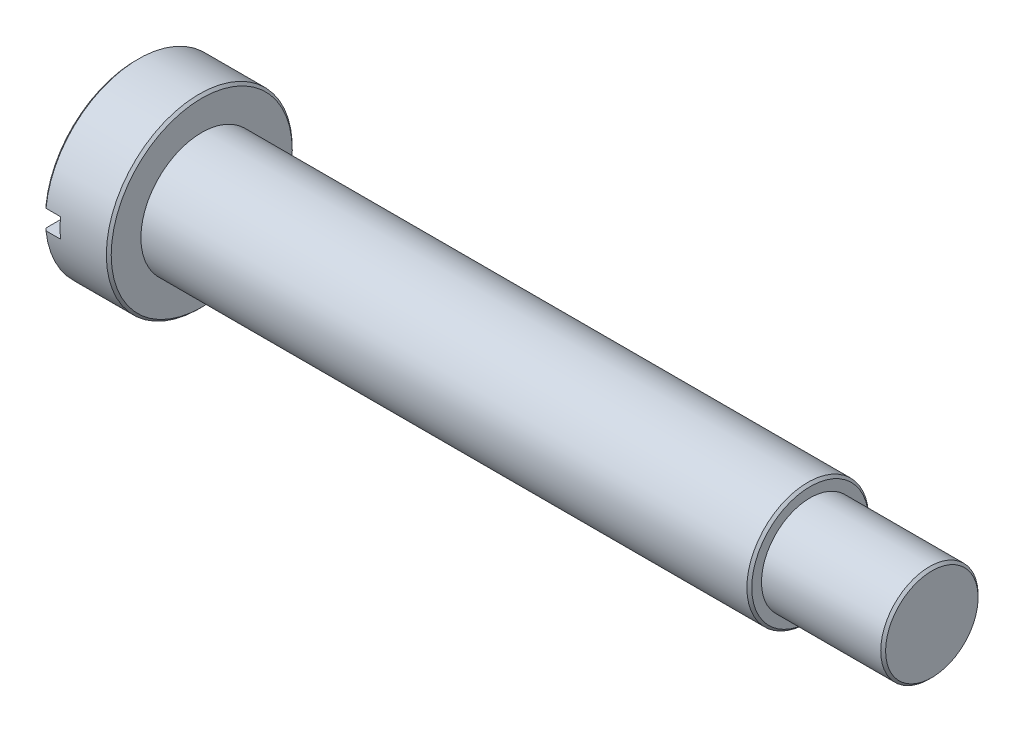
ISO-10303-21;
HEADER;
FILE_DESCRIPTION(('STEP AP214'),'2;1');
FILE_NAME('part.step','',(''),(''),'','','');
FILE_SCHEMA(('AUTOMOTIVE_DESIGN { 1 0 10303 214 1 1 1 1 }'));
ENDSEC;
DATA;
#1=APPLICATION_CONTEXT('core data for automotive mechanical design processes');
#2=APPLICATION_PROTOCOL_DEFINITION('international standard','automotive_design',2000,#1);
#3=PRODUCT_CONTEXT('',#1,'mechanical');
#4=PRODUCT('Part','Part','',(#3));
#5=PRODUCT_RELATED_PRODUCT_CATEGORY('part','',(#4));
#6=PRODUCT_DEFINITION_FORMATION('','',#4);
#7=PRODUCT_DEFINITION_CONTEXT('part definition',#1,'design');
#8=PRODUCT_DEFINITION('design','',#6,#7);
#9=PRODUCT_DEFINITION_SHAPE('','',#8);
#10=(LENGTH_UNIT() NAMED_UNIT(*) SI_UNIT(.MILLI.,.METRE.));
#11=(NAMED_UNIT(*) PLANE_ANGLE_UNIT() SI_UNIT($,.RADIAN.));
#12=(NAMED_UNIT(*) SI_UNIT($,.STERADIAN.) SOLID_ANGLE_UNIT());
#13=UNCERTAINTY_MEASURE_WITH_UNIT(LENGTH_MEASURE(1.E-05),#10,'distance_accuracy_value','');
#14=(GEOMETRIC_REPRESENTATION_CONTEXT(3) GLOBAL_UNCERTAINTY_ASSIGNED_CONTEXT((#13)) GLOBAL_UNIT_ASSIGNED_CONTEXT((#10,
#11,#12)) REPRESENTATION_CONTEXT('',''));
#15=CARTESIAN_POINT('',(0.,0.,0.));
#16=DIRECTION('',(0.,0.,1.));
#17=DIRECTION('',(1.,0.,0.));
#18=AXIS2_PLACEMENT_3D('',#15,#16,#17);
#19=CARTESIAN_POINT('',(0.,0.,0.));
#20=DIRECTION('',(1.,0.,0.));
#21=DIRECTION('',(0.,0.,-1.));
#22=AXIS2_PLACEMENT_3D('',#19,#20,#21);
#23=PLANE('',#22);
#24=DIRECTION('',(0.,0.,1.));
#25=VECTOR('',#24,1.);
#26=CARTESIAN_POINT('',(0.,-0.4,-4.02178863795477));
#27=LINE('',#26,#25);
#28=CARTESIAN_POINT('',(0.,-0.4,-3.69843210022842));
#29=VERTEX_POINT('',#28);
#30=CARTESIAN_POINT('',(0.,-0.4,3.69843210022842));
#31=VERTEX_POINT('',#30);
#32=EDGE_CURVE('E71',#29,#31,#27,.T.);
#33=ORIENTED_EDGE('',*,*,#32,.F.);
#34=CARTESIAN_POINT('',(0.,0.,0.));
#35=DIRECTION('',(1.,0.,0.));
#36=DIRECTION('',(0.,0.,-1.));
#37=AXIS2_PLACEMENT_3D('',#34,#35,#36);
#38=CIRCLE('',#37,3.72);
#39=EDGE_CURVE('E81',#29,#31,#38,.F.);
#40=ORIENTED_EDGE('',*,*,#39,.T.);
#41=EDGE_LOOP('',(#33,#40));
#42=FACE_BOUND('',#41,.T.);
#43=ADVANCED_FACE('F16',(#42),#23,.F.);
#44=CARTESIAN_POINT('',(0.,0.,0.));
#45=DIRECTION('',(-1.,0.,0.));
#46=DIRECTION('',(0.,0.,1.));
#47=AXIS2_PLACEMENT_3D('',#44,#45,#46);
#48=CYLINDRICAL_SURFACE('',#47,3.82);
#49=CARTESIAN_POINT('',(2.6,0.,0.));
#50=DIRECTION('',(-1.,0.,0.));
#51=DIRECTION('',(0.,0.,1.));
#52=AXIS2_PLACEMENT_3D('',#49,#50,#51);
#53=CIRCLE('',#52,3.82);
#54=CARTESIAN_POINT('',(2.6,0.,3.82));
#55=VERTEX_POINT('',#54);
#56=EDGE_CURVE('E91',#55,#55,#53,.T.);
#57=ORIENTED_EDGE('',*,*,#56,.T.);
#58=EDGE_LOOP('',(#57));
#59=FACE_BOUND('',#58,.T.);
#60=DIRECTION('',(-1.,0.,0.));
#61=VECTOR('',#60,1.);
#62=CARTESIAN_POINT('',(0.,-0.4,3.79899986838642));
#63=LINE('',#62,#61);
#64=CARTESIAN_POINT('',(0.1,-0.4,3.79899986838642));
#65=VERTEX_POINT('',#64);
#66=CARTESIAN_POINT('',(0.7,-0.4,3.79899986838642));
#67=VERTEX_POINT('',#66);
#68=EDGE_CURVE('E58',#65,#67,#63,.F.);
#69=ORIENTED_EDGE('',*,*,#68,.F.);
#70=CARTESIAN_POINT('',(0.1,0.,0.));
#71=DIRECTION('',(1.,0.,0.));
#72=DIRECTION('',(0.,0.,-1.));
#73=AXIS2_PLACEMENT_3D('',#70,#71,#72);
#74=CIRCLE('',#73,3.82);
#75=CARTESIAN_POINT('',(0.1,-0.4,-3.79899986838642));
#76=VERTEX_POINT('',#75);
#77=EDGE_CURVE('E79',#65,#76,#74,.T.);
#78=ORIENTED_EDGE('',*,*,#77,.T.);
#79=DIRECTION('',(-1.,0.,0.));
#80=VECTOR('',#79,1.);
#81=CARTESIAN_POINT('',(0.,-0.4,-3.79899986838642));
#82=LINE('',#81,#80);
#83=CARTESIAN_POINT('',(0.7,-0.4,-3.79899986838642));
#84=VERTEX_POINT('',#83);
#85=EDGE_CURVE('E65',#84,#76,#82,.T.);
#86=ORIENTED_EDGE('',*,*,#85,.F.);
#87=CARTESIAN_POINT('',(0.7,0.,0.));
#88=DIRECTION('',(1.,0.,0.));
#89=DIRECTION('',(0.,0.,-1.));
#90=AXIS2_PLACEMENT_3D('',#87,#88,#89);
#91=CIRCLE('',#90,3.82);
#92=CARTESIAN_POINT('',(0.7,0.4,-3.79899986838642));
#93=VERTEX_POINT('',#92);
#94=EDGE_CURVE('E215',#84,#93,#91,.T.);
#95=ORIENTED_EDGE('',*,*,#94,.T.);
#96=DIRECTION('',(-1.,0.,0.));
#97=VECTOR('',#96,1.);
#98=CARTESIAN_POINT('',(0.,0.4,-3.79899986838642));
#99=LINE('',#98,#97);
#100=CARTESIAN_POINT('',(0.1,0.4,-3.79899986838642));
#101=VERTEX_POINT('',#100);
#102=EDGE_CURVE('E206',#93,#101,#99,.T.);
#103=ORIENTED_EDGE('',*,*,#102,.T.);
#104=CARTESIAN_POINT('',(0.1,0.4,3.79899986838642));
#105=VERTEX_POINT('',#104);
#106=EDGE_CURVE('E87',#101,#105,#74,.T.);
#107=ORIENTED_EDGE('',*,*,#106,.T.);
#108=DIRECTION('',(-1.,0.,0.));
#109=VECTOR('',#108,1.);
#110=CARTESIAN_POINT('',(0.,0.4,3.79899986838642));
#111=LINE('',#110,#109);
#112=CARTESIAN_POINT('',(0.7,0.4,3.79899986838642));
#113=VERTEX_POINT('',#112);
#114=EDGE_CURVE('E72',#105,#113,#111,.F.);
#115=ORIENTED_EDGE('',*,*,#114,.T.);
#116=EDGE_CURVE('E185',#113,#67,#91,.T.);
#117=ORIENTED_EDGE('',*,*,#116,.T.);
#118=EDGE_LOOP('',(#69,#78,#86,#95,#103,#107,#115,#117));
#119=FACE_BOUND('',#118,.T.);
#120=ADVANCED_FACE('F85',(#59,#119),#48,.T.);
#121=CARTESIAN_POINT('',(0.,0.,0.));
#122=DIRECTION('',(1.,0.,0.));
#123=DIRECTION('',(0.,0.,-1.));
#124=AXIS2_PLACEMENT_3D('',#121,#122,#123);
#125=CONICAL_SURFACE('',#124,3.72,0.785398163397463);
#126=ORIENTED_EDGE('',*,*,#77,.F.);
#127=CARTESIAN_POINT('',(0.1007,-0.4,3.7997037371353));
#128=CARTESIAN_POINT('',(-0.00972371970865544,-0.4,3.68866729835541));
#129=CARTESIAN_POINT('',(-0.120123222613816,-0.4,3.57760675645919));
#130=CARTESIAN_POINT('',(-0.340866293965101,-0.4,3.35540033500685));
#131=CARTESIAN_POINT('',(-0.451209852856851,-0.4,3.24425444595992));
#132=CARTESIAN_POINT('',(-0.672160782659812,-0.4,3.02151019475965));
#133=CARTESIAN_POINT('',(-0.782767851250642,-0.4,2.90991153260454));
#134=CARTESIAN_POINT('',(-1.00383405554618,-0.4,2.68659720077042));
#135=CARTESIAN_POINT('',(-1.1142932089712,-0.4,2.57488154862966));
#136=CARTESIAN_POINT('',(-1.37677934485607,-0.4,2.30896314497578));
#137=CARTESIAN_POINT('',(-1.52872188103554,-0.4,2.15467689965763));
#138=CARTESIAN_POINT('',(-1.75617017140396,-0.4,1.92271986173873));
#139=CARTESIAN_POINT('',(-1.83192633307621,-0.4,1.84529474735761));
#140=CARTESIAN_POINT('',(-1.98318929887579,-0.4,1.69020899067442));
#141=CARTESIAN_POINT('',(-2.05869611559696,-0.4,1.61254836065986));
#142=CARTESIAN_POINT('',(-2.20912652789578,-0.4,1.45709480485107));
#143=CARTESIAN_POINT('',(-2.28405117576121,-0.4,1.3793028999174));
#144=CARTESIAN_POINT('',(-2.43332217520878,-0.4,1.22313746860251));
#145=CARTESIAN_POINT('',(-2.50766841171401,-0.4,1.14476383225317));
#146=CARTESIAN_POINT('',(-2.65528169584368,-0.4,0.987126446716258));
#147=CARTESIAN_POINT('',(-2.72854963805339,-0.4,0.90786354420224));
#148=CARTESIAN_POINT('',(-2.8368556750095,-0.4,0.787551663029682));
#149=CARTESIAN_POINT('',(-2.87268624955578,-0.4,0.747217842692174));
#150=CARTESIAN_POINT('',(-2.94351939455795,-0.4,0.665831381432158));
#151=CARTESIAN_POINT('',(-2.97852206733132,-0.4,0.624778830437884));
#152=CARTESIAN_POINT('',(-3.02622994148695,-0.4,0.566921061568795));
#153=CARTESIAN_POINT('',(-3.03951592354927,-0.4,0.550595790860314));
#154=CARTESIAN_POINT('',(-3.06582172752263,-0.4,0.517731680880178));
#155=CARTESIAN_POINT('',(-3.07884153623833,-0.4,0.501192831086506));
#156=CARTESIAN_POINT('',(-3.11746393595511,-0.4,0.451117290517626));
#157=CARTESIAN_POINT('',(-3.14257199609554,-0.4,0.41719033959251));
#158=CARTESIAN_POINT('',(-3.19001337606982,-0.4,0.348555883904446));
#159=CARTESIAN_POINT('',(-3.21239640063317,-0.4,0.313883094724452));
#160=CARTESIAN_POINT('',(-3.2532399648461,-0.4,0.242340300030416));
#161=CARTESIAN_POINT('',(-3.27171685404829,-0.4,0.205480314595571));
#162=CARTESIAN_POINT('',(-3.29570703953476,-0.4,0.143195664004333));
#163=CARTESIAN_POINT('',(-3.30348274034931,-0.4,0.11867747207689));
#164=CARTESIAN_POINT('',(-3.31485026142036,-0.4,0.0687704372124475));
#165=CARTESIAN_POINT('',(-3.31846478942032,-0.4,0.0433871055109426));
#166=CARTESIAN_POINT('',(-3.3207442045827,-0.4,-0.00780300542246746));
#167=CARTESIAN_POINT('',(-3.31937274951796,-0.4,-0.0336115233253419));
#168=CARTESIAN_POINT('',(-3.31193891452746,-0.4,-0.0846123821800508));
#169=CARTESIAN_POINT('',(-3.30585587531209,-0.4,-0.109801504048273));
#170=CARTESIAN_POINT('',(-3.29180716381071,-0.4,-0.153928519325698));
#171=CARTESIAN_POINT('',(-3.28448790335838,-0.4,-0.173084817302385));
#172=CARTESIAN_POINT('',(-3.26821785185456,-0.4,-0.210700379357752));
#173=CARTESIAN_POINT('',(-3.25926568099253,-0.4,-0.229159037884277));
#174=CARTESIAN_POINT('',(-3.24014301093223,-0.4,-0.265524721764036));
#175=CARTESIAN_POINT('',(-3.22996743274077,-0.4,-0.283429030241373));
#176=CARTESIAN_POINT('',(-3.20875241480667,-0.4,-0.318702141179415));
#177=CARTESIAN_POINT('',(-3.19771336182962,-0.4,-0.336071178592515));
#178=CARTESIAN_POINT('',(-3.15916074661242,-0.4,-0.394338436316087));
#179=CARTESIAN_POINT('',(-3.13015663523335,-0.4,-0.434243417041458));
#180=CARTESIAN_POINT('',(-3.07026411311731,-0.4,-0.512623361721481));
#181=CARTESIAN_POINT('',(-3.03937400706867,-0.4,-0.551096987526727));
#182=CARTESIAN_POINT('',(-2.97640342098523,-0.4,-0.627211094419027));
#183=CARTESIAN_POINT('',(-2.94432026235579,-0.4,-0.664849354717811));
#184=CARTESIAN_POINT('',(-2.87945873095953,-0.4,-0.73949047105323));
#185=CARTESIAN_POINT('',(-2.84668064295612,-0.4,-0.776493576525954));
#186=CARTESIAN_POINT('',(-2.74740878449286,-0.4,-0.887138172717233));
#187=CARTESIAN_POINT('',(-2.68020827487207,-0.4,-0.960144088612486));
#188=CARTESIAN_POINT('',(-2.54495998246372,-0.4,-1.10515969558673));
#189=CARTESIAN_POINT('',(-2.47691357493903,-0.4,-1.17717068177926));
#190=CARTESIAN_POINT('',(-2.30464527557632,-0.4,-1.35807148660064));
#191=CARTESIAN_POINT('',(-2.20005930610626,-0.4,-1.46661441852072));
#192=CARTESIAN_POINT('',(-1.99024071578729,-0.4,-1.68307603412219));
#193=CARTESIAN_POINT('',(-1.88500807789701,-0.4,-1.79099470120586));
#194=CARTESIAN_POINT('',(-1.5686133180435,-0.4,-2.11435634893406));
#195=CARTESIAN_POINT('',(-1.3568971577934,-0.4,-2.32925701010926));
#196=CARTESIAN_POINT('',(-0.937619570011003,-0.4,-2.75365575466617));
#197=CARTESIAN_POINT('',(-0.73007138311911,-0.4,-2.96316696702083));
#198=CARTESIAN_POINT('',(-0.418586842408643,-0.4,-3.27711768345285));
#199=CARTESIAN_POINT('',(-0.314770508333443,-0.4,-3.38167616062694));
#200=CARTESIAN_POINT('',(-0.1070766662361,-0.4,-3.59073153550957));
#201=CARTESIAN_POINT('',(-0.00319915845335339,-0.4,-3.69522843345593));
#202=CARTESIAN_POINT('',(0.100699999999998,-0.4,-3.7997037371353));
#203=B_SPLINE_CURVE_WITH_KNOTS('',3,(#127,#128,#129,#130,#131,#132,#133,#134,#135,#136,#137,
#138,#139,#140,#141,#142,#143,#144,#145,#146,#147,#148,#149,#150,#151,#152,#153,#154,#155,#156,
#157,#158,#159,#160,#161,#162,#163,#164,#165,#166,#167,#168,#169,#170,#171,#172,#173,#174,#175,
#176,#177,#178,#179,#180,#181,#182,#183,#184,#185,#186,#187,#188,#189,#190,#191,#192,#193,#194,
#195,#196,#197,#198,#199,#200,#201,#202),.UNSPECIFIED.,.F.,.F.,(4,2,2,2,2,2,2,2,2,2,2,2,2,2,2,2,
2,2,2,2,2,2,2,2,2,2,2,2,2,2,2,2,2,2,2,2,2,4),(0.,0.469789752238243,0.939642877822411,
1.41101700288855,1.88232842815591,2.53195545739926,2.8569209029871,3.1818696762835,
3.50588500997478,3.82996323868161,4.15375543334238,4.31560110540631,4.47742666989952,
4.54056892533293,4.60371430344026,4.73027378918795,4.85398691523111,4.97717149944682,
5.05407625616299,5.13055931990218,5.20760097345261,5.28498236395221,5.34641526261287,
5.40790031464656,5.46965005985584,5.53137230292987,5.67923634506999,5.82723531629428,
5.97558943166404,6.12388388757924,6.42154008130772,6.71876312383801,7.17094853894681,
7.62314592183534,8.52815759394615,9.4128841158044,9.85491658820589,10.2969473420972),.UNSPECIFIED.);
#204=EDGE_CURVE('E82',#65,#31,#203,.T.);
#205=ORIENTED_EDGE('',*,*,#204,.T.);
#206=ORIENTED_EDGE('',*,*,#39,.F.);
#207=EDGE_CURVE('E51',#29,#76,#203,.T.);
#208=ORIENTED_EDGE('',*,*,#207,.T.);
#209=EDGE_LOOP('',(#126,#205,#206,#208));
#210=FACE_BOUND('',#209,.T.);
#211=ADVANCED_FACE('F77',(#210),#125,.T.);
#212=CARTESIAN_POINT('',(0.,0.4,3.69843210022842));
#213=VERTEX_POINT('',#212);
#214=CARTESIAN_POINT('',(0.,0.4,-3.69843210022842));
#215=VERTEX_POINT('',#214);
#216=EDGE_CURVE('E102',#213,#215,#38,.F.);
#217=ORIENTED_EDGE('',*,*,#216,.T.);
#218=DIRECTION('',(0.,0.,-1.));
#219=VECTOR('',#218,1.);
#220=CARTESIAN_POINT('',(0.,0.4,0.));
#221=LINE('',#220,#219);
#222=EDGE_CURVE('E34',#215,#213,#221,.F.);
#223=ORIENTED_EDGE('',*,*,#222,.T.);
#224=EDGE_LOOP('',(#217,#223));
#225=FACE_BOUND('',#224,.T.);
#226=ADVANCED_FACE('F151',(#225),#23,.F.);
#227=CARTESIAN_POINT('',(2.7,3.82,0.));
#228=DIRECTION('',(-1.,0.,0.));
#229=DIRECTION('',(0.,0.,1.));
#230=AXIS2_PLACEMENT_3D('',#227,#228,#229);
#231=PLANE('',#230);
#232=CARTESIAN_POINT('',(2.7,0.,0.));
#233=DIRECTION('',(-1.,0.,0.));
#234=DIRECTION('',(0.,0.,1.));
#235=AXIS2_PLACEMENT_3D('',#232,#233,#234);
#236=CIRCLE('',#235,3.72);
#237=CARTESIAN_POINT('',(2.7,0.,3.72));
#238=VERTEX_POINT('',#237);
#239=EDGE_CURVE('E99',#238,#238,#236,.F.);
#240=ORIENTED_EDGE('',*,*,#239,.T.);
#241=EDGE_LOOP('',(#240));
#242=FACE_BOUND('',#241,.T.);
#243=CARTESIAN_POINT('',(2.7,0.,0.));
#244=DIRECTION('',(-1.,0.,0.));
#245=DIRECTION('',(0.,0.,1.));
#246=AXIS2_PLACEMENT_3D('',#243,#244,#245);
#247=CIRCLE('',#246,2.5);
#248=CARTESIAN_POINT('',(2.7,0.,2.5));
#249=VERTEX_POINT('',#248);
#250=EDGE_CURVE('E88',#249,#249,#247,.T.);
#251=ORIENTED_EDGE('',*,*,#250,.T.);
#252=EDGE_LOOP('',(#251));
#253=FACE_BOUND('',#252,.T.);
#254=ADVANCED_FACE('F147',(#242,#253),#231,.F.);
#255=CARTESIAN_POINT('',(0.,0.,0.));
#256=DIRECTION('',(-1.,0.,0.));
#257=DIRECTION('',(0.,0.,1.));
#258=AXIS2_PLACEMENT_3D('',#255,#256,#257);
#259=CYLINDRICAL_SURFACE('',#258,2.5);
#260=CARTESIAN_POINT('',(27.6,0.,0.));
#261=DIRECTION('',(-1.,0.,0.));
#262=DIRECTION('',(0.,0.,1.));
#263=AXIS2_PLACEMENT_3D('',#260,#261,#262);
#264=CIRCLE('',#263,2.5);
#265=CARTESIAN_POINT('',(27.6,0.,2.5));
#266=VERTEX_POINT('',#265);
#267=EDGE_CURVE('E26',#266,#266,#264,.T.);
#268=ORIENTED_EDGE('',*,*,#267,.T.);
#269=EDGE_LOOP('',(#268));
#270=FACE_BOUND('',#269,.T.);
#271=ORIENTED_EDGE('',*,*,#250,.F.);
#272=EDGE_LOOP('',(#271));
#273=FACE_BOUND('',#272,.T.);
#274=ADVANCED_FACE('F143',(#270,#273),#259,.T.);
#275=CARTESIAN_POINT('',(27.7,2.5,0.));
#276=DIRECTION('',(-1.,0.,0.));
#277=DIRECTION('',(0.,0.,1.));
#278=AXIS2_PLACEMENT_3D('',#275,#276,#277);
#279=PLANE('',#278);
#280=CARTESIAN_POINT('',(27.7,0.,0.));
#281=DIRECTION('',(-1.,0.,0.));
#282=DIRECTION('',(0.,0.,1.));
#283=AXIS2_PLACEMENT_3D('',#280,#281,#282);
#284=CIRCLE('',#283,2.4);
#285=CARTESIAN_POINT('',(27.7,0.,2.4));
#286=VERTEX_POINT('',#285);
#287=EDGE_CURVE('E11',#286,#286,#284,.F.);
#288=ORIENTED_EDGE('',*,*,#287,.T.);
#289=EDGE_LOOP('',(#288));
#290=FACE_BOUND('',#289,.T.);
#291=CARTESIAN_POINT('',(27.7,0.,0.));
#292=DIRECTION('',(-1.,0.,0.));
#293=DIRECTION('',(0.,0.,1.));
#294=AXIS2_PLACEMENT_3D('',#291,#292,#293);
#295=CIRCLE('',#294,2.);
#296=CARTESIAN_POINT('',(27.7,0.,2.));
#297=VERTEX_POINT('',#296);
#298=EDGE_CURVE('E93',#297,#297,#295,.T.);
#299=ORIENTED_EDGE('',*,*,#298,.T.);
#300=EDGE_LOOP('',(#299));
#301=FACE_BOUND('',#300,.T.);
#302=ADVANCED_FACE('F139',(#290,#301),#279,.F.);
#303=CARTESIAN_POINT('',(0.,0.,0.));
#304=DIRECTION('',(-1.,0.,0.));
#305=DIRECTION('',(0.,0.,1.));
#306=AXIS2_PLACEMENT_3D('',#303,#304,#305);
#307=CYLINDRICAL_SURFACE('',#306,2.);
#308=CARTESIAN_POINT('',(32.6,0.,0.));
#309=DIRECTION('',(-1.,0.,0.));
#310=DIRECTION('',(0.,0.,1.));
#311=AXIS2_PLACEMENT_3D('',#308,#309,#310);
#312=CIRCLE('',#311,2.);
#313=CARTESIAN_POINT('',(32.6,0.,2.));
#314=VERTEX_POINT('',#313);
#315=EDGE_CURVE('E181',#314,#314,#312,.T.);
#316=ORIENTED_EDGE('',*,*,#315,.T.);
#317=EDGE_LOOP('',(#316));
#318=FACE_BOUND('',#317,.T.);
#319=ORIENTED_EDGE('',*,*,#298,.F.);
#320=EDGE_LOOP('',(#319));
#321=FACE_BOUND('',#320,.T.);
#322=ADVANCED_FACE('F135',(#318,#321),#307,.T.);
#323=CARTESIAN_POINT('',(32.7,2.,0.));
#324=DIRECTION('',(-1.,0.,0.));
#325=DIRECTION('',(0.,0.,1.));
#326=AXIS2_PLACEMENT_3D('',#323,#324,#325);
#327=PLANE('',#326);
#328=CARTESIAN_POINT('',(32.7,0.,0.));
#329=DIRECTION('',(-1.,0.,0.));
#330=DIRECTION('',(0.,0.,1.));
#331=AXIS2_PLACEMENT_3D('',#328,#329,#330);
#332=CIRCLE('',#331,1.9);
#333=CARTESIAN_POINT('',(32.7,0.,1.9));
#334=VERTEX_POINT('',#333);
#335=EDGE_CURVE('E184',#334,#334,#332,.F.);
#336=ORIENTED_EDGE('',*,*,#335,.T.);
#337=EDGE_LOOP('',(#336));
#338=FACE_BOUND('',#337,.T.);
#339=ADVANCED_FACE('F131',(#338),#327,.F.);
#340=CARTESIAN_POINT('',(2.6,0.,0.));
#341=DIRECTION('',(-1.,0.,0.));
#342=DIRECTION('',(0.,0.,1.));
#343=AXIS2_PLACEMENT_3D('',#340,#341,#342);
#344=CONICAL_SURFACE('',#343,3.82,0.78539816339745);
#345=ORIENTED_EDGE('',*,*,#239,.F.);
#346=EDGE_LOOP('',(#345));
#347=FACE_BOUND('',#346,.T.);
#348=ORIENTED_EDGE('',*,*,#56,.F.);
#349=EDGE_LOOP('',(#348));
#350=FACE_BOUND('',#349,.T.);
#351=ADVANCED_FACE('F134',(#347,#350),#344,.T.);
#352=CARTESIAN_POINT('',(0.1007,0.4,3.7997037371353));
#353=CARTESIAN_POINT('',(-0.00972371970865544,0.4,3.68866729835541));
#354=CARTESIAN_POINT('',(-0.120123222613816,0.4,3.57760675645919));
#355=CARTESIAN_POINT('',(-0.340866293965101,0.4,3.35540033500685));
#356=CARTESIAN_POINT('',(-0.451209852856851,0.4,3.24425444595992));
#357=CARTESIAN_POINT('',(-0.672160782659812,0.4,3.02151019475965));
#358=CARTESIAN_POINT('',(-0.782767851250642,0.4,2.90991153260454));
#359=CARTESIAN_POINT('',(-1.00383405554618,0.4,2.68659720077042));
#360=CARTESIAN_POINT('',(-1.1142932089712,0.4,2.57488154862966));
#361=CARTESIAN_POINT('',(-1.37677934485607,0.4,2.30896314497578));
#362=CARTESIAN_POINT('',(-1.52872188103554,0.4,2.15467689965763));
#363=CARTESIAN_POINT('',(-1.75617017140396,0.4,1.92271986173873));
#364=CARTESIAN_POINT('',(-1.83192633307621,0.4,1.84529474735761));
#365=CARTESIAN_POINT('',(-1.98318929887579,0.4,1.69020899067442));
#366=CARTESIAN_POINT('',(-2.05869611559696,0.4,1.61254836065986));
#367=CARTESIAN_POINT('',(-2.20912652789578,0.4,1.45709480485107));
#368=CARTESIAN_POINT('',(-2.28405117576121,0.4,1.3793028999174));
#369=CARTESIAN_POINT('',(-2.43332217520878,0.4,1.22313746860251));
#370=CARTESIAN_POINT('',(-2.50766841171401,0.4,1.14476383225317));
#371=CARTESIAN_POINT('',(-2.65528169584368,0.4,0.987126446716258));
#372=CARTESIAN_POINT('',(-2.72854963805339,0.4,0.90786354420224));
#373=CARTESIAN_POINT('',(-2.8368556750095,0.4,0.787551663029682));
#374=CARTESIAN_POINT('',(-2.87268624955578,0.4,0.747217842692174));
#375=CARTESIAN_POINT('',(-2.94351939455795,0.4,0.665831381432158));
#376=CARTESIAN_POINT('',(-2.97852206733132,0.4,0.624778830437884));
#377=CARTESIAN_POINT('',(-3.02622994148695,0.4,0.566921061568795));
#378=CARTESIAN_POINT('',(-3.03951592354927,0.4,0.550595790860314));
#379=CARTESIAN_POINT('',(-3.06582172752263,0.4,0.517731680880178));
#380=CARTESIAN_POINT('',(-3.07884153623833,0.4,0.501192831086506));
#381=CARTESIAN_POINT('',(-3.11746393595511,0.4,0.451117290517626));
#382=CARTESIAN_POINT('',(-3.14257199609554,0.4,0.41719033959251));
#383=CARTESIAN_POINT('',(-3.19001337606982,0.4,0.348555883904446));
#384=CARTESIAN_POINT('',(-3.21239640063317,0.4,0.313883094724452));
#385=CARTESIAN_POINT('',(-3.2532399648461,0.4,0.242340300030416));
#386=CARTESIAN_POINT('',(-3.27171685404829,0.4,0.205480314595571));
#387=CARTESIAN_POINT('',(-3.29570703953476,0.4,0.143195664004333));
#388=CARTESIAN_POINT('',(-3.30348274034931,0.4,0.11867747207689));
#389=CARTESIAN_POINT('',(-3.31485026142036,0.4,0.0687704372124475));
#390=CARTESIAN_POINT('',(-3.31846478942032,0.4,0.0433871055109426));
#391=CARTESIAN_POINT('',(-3.3207442045827,0.4,-0.00780300542246746));
#392=CARTESIAN_POINT('',(-3.31937274951796,0.4,-0.0336115233253419));
#393=CARTESIAN_POINT('',(-3.31193891452746,0.4,-0.0846123821800508));
#394=CARTESIAN_POINT('',(-3.30585587531209,0.4,-0.109801504048273));
#395=CARTESIAN_POINT('',(-3.29180716381071,0.4,-0.153928519325698));
#396=CARTESIAN_POINT('',(-3.28448790335838,0.4,-0.173084817302385));
#397=CARTESIAN_POINT('',(-3.26821785185456,0.4,-0.210700379357752));
#398=CARTESIAN_POINT('',(-3.25926568099253,0.4,-0.229159037884277));
#399=CARTESIAN_POINT('',(-3.24014301093223,0.4,-0.265524721764036));
#400=CARTESIAN_POINT('',(-3.22996743274077,0.4,-0.283429030241373));
#401=CARTESIAN_POINT('',(-3.20875241480667,0.4,-0.318702141179415));
#402=CARTESIAN_POINT('',(-3.19771336182962,0.4,-0.336071178592515));
#403=CARTESIAN_POINT('',(-3.15916074661242,0.4,-0.394338436316087));
#404=CARTESIAN_POINT('',(-3.13015663523335,0.4,-0.434243417041458));
#405=CARTESIAN_POINT('',(-3.07026411311731,0.4,-0.512623361721481));
#406=CARTESIAN_POINT('',(-3.03937400706867,0.4,-0.551096987526727));
#407=CARTESIAN_POINT('',(-2.97640342098523,0.4,-0.627211094419027));
#408=CARTESIAN_POINT('',(-2.94432026235579,0.4,-0.664849354717811));
#409=CARTESIAN_POINT('',(-2.87945873095953,0.4,-0.73949047105323));
#410=CARTESIAN_POINT('',(-2.84668064295612,0.4,-0.776493576525954));
#411=CARTESIAN_POINT('',(-2.74740878449286,0.4,-0.887138172717233));
#412=CARTESIAN_POINT('',(-2.68020827487207,0.4,-0.960144088612486));
#413=CARTESIAN_POINT('',(-2.54495998246372,0.4,-1.10515969558673));
#414=CARTESIAN_POINT('',(-2.47691357493903,0.4,-1.17717068177926));
#415=CARTESIAN_POINT('',(-2.30464527557632,0.4,-1.35807148660064));
#416=CARTESIAN_POINT('',(-2.20005930610626,0.4,-1.46661441852072));
#417=CARTESIAN_POINT('',(-1.99024071578729,0.4,-1.68307603412219));
#418=CARTESIAN_POINT('',(-1.88500807789701,0.4,-1.79099470120586));
#419=CARTESIAN_POINT('',(-1.5686133180435,0.4,-2.11435634893406));
#420=CARTESIAN_POINT('',(-1.3568971577934,0.4,-2.32925701010926));
#421=CARTESIAN_POINT('',(-0.937619570011003,0.4,-2.75365575466617));
#422=CARTESIAN_POINT('',(-0.73007138311911,0.4,-2.96316696702083));
#423=CARTESIAN_POINT('',(-0.418586842408643,0.4,-3.27711768345285));
#424=CARTESIAN_POINT('',(-0.314770508333443,0.4,-3.38167616062694));
#425=CARTESIAN_POINT('',(-0.1070766662361,0.4,-3.59073153550957));
#426=CARTESIAN_POINT('',(-0.00319915845335339,0.4,-3.69522843345593));
#427=CARTESIAN_POINT('',(0.100699999999998,0.4,-3.7997037371353));
#428=B_SPLINE_CURVE_WITH_KNOTS('',3,(#352,#353,#354,#355,#356,#357,#358,#359,#360,#361,#362,
#363,#364,#365,#366,#367,#368,#369,#370,#371,#372,#373,#374,#375,#376,#377,#378,#379,#380,#381,
#382,#383,#384,#385,#386,#387,#388,#389,#390,#391,#392,#393,#394,#395,#396,#397,#398,#399,#400,
#401,#402,#403,#404,#405,#406,#407,#408,#409,#410,#411,#412,#413,#414,#415,#416,#417,#418,#419,
#420,#421,#422,#423,#424,#425,#426,#427),.UNSPECIFIED.,.F.,.F.,(4,2,2,2,2,2,2,2,2,2,2,2,2,2,2,2,
2,2,2,2,2,2,2,2,2,2,2,2,2,2,2,2,2,2,2,2,2,4),(0.,0.469789752238243,0.939642877822411,
1.41101700288855,1.88232842815591,2.53195545739926,2.8569209029871,3.1818696762835,
3.50588500997478,3.82996323868161,4.15375543334238,4.31560110540631,4.47742666989952,
4.54056892533293,4.60371430344026,4.73027378918795,4.85398691523111,4.97717149944682,
5.05407625616299,5.13055931990218,5.20760097345261,5.28498236395221,5.34641526261287,
5.40790031464656,5.46965005985584,5.53137230292987,5.67923634506999,5.82723531629428,
5.97558943166404,6.12388388757924,6.42154008130772,6.71876312383801,7.17094853894681,
7.62314592183534,8.52815759394615,9.4128841158044,9.85491658820589,10.2969473420972),.UNSPECIFIED.);
#429=EDGE_CURVE('E83',#105,#213,#428,.T.);
#430=ORIENTED_EDGE('',*,*,#429,.F.);
#431=ORIENTED_EDGE('',*,*,#106,.F.);
#432=EDGE_CURVE('E105',#215,#101,#428,.T.);
#433=ORIENTED_EDGE('',*,*,#432,.F.);
#434=ORIENTED_EDGE('',*,*,#216,.F.);
#435=EDGE_LOOP('',(#430,#431,#433,#434));
#436=FACE_BOUND('',#435,.T.);
#437=ADVANCED_FACE('F119',(#436),#125,.T.);
#438=CARTESIAN_POINT('',(0.7,0.,0.));
#439=DIRECTION('',(1.,0.,0.));
#440=DIRECTION('',(0.,0.,-1.));
#441=AXIS2_PLACEMENT_3D('',#438,#439,#440);
#442=PLANE('',#441);
#443=DIRECTION('',(0.,0.,1.));
#444=VECTOR('',#443,1.);
#445=CARTESIAN_POINT('',(0.7,0.4,-4.02178863795477));
#446=LINE('',#445,#444);
#447=EDGE_CURVE('E209',#93,#113,#446,.T.);
#448=ORIENTED_EDGE('',*,*,#447,.F.);
#449=ORIENTED_EDGE('',*,*,#94,.F.);
#450=DIRECTION('',(0.,0.,1.));
#451=VECTOR('',#450,1.);
#452=CARTESIAN_POINT('',(0.7,-0.4,-4.02178863795477));
#453=LINE('',#452,#451);
#454=EDGE_CURVE('E67',#84,#67,#453,.T.);
#455=ORIENTED_EDGE('',*,*,#454,.T.);
#456=ORIENTED_EDGE('',*,*,#116,.F.);
#457=EDGE_LOOP('',(#448,#449,#455,#456));
#458=FACE_BOUND('',#457,.T.);
#459=ADVANCED_FACE('F127',(#458),#442,.F.);
#460=CARTESIAN_POINT('',(-1.2E-05,-0.4,-4.02178863795477));
#461=DIRECTION('',(0.,1.,0.));
#462=DIRECTION('',(0.,0.,1.));
#463=AXIS2_PLACEMENT_3D('',#460,#461,#462);
#464=PLANE('',#463);
#465=ORIENTED_EDGE('',*,*,#68,.T.);
#466=ORIENTED_EDGE('',*,*,#454,.F.);
#467=ORIENTED_EDGE('',*,*,#85,.T.);
#468=ORIENTED_EDGE('',*,*,#207,.F.);
#469=ORIENTED_EDGE('',*,*,#32,.T.);
#470=ORIENTED_EDGE('',*,*,#204,.F.);
#471=EDGE_LOOP('',(#465,#466,#467,#468,#469,#470));
#472=FACE_BOUND('',#471,.T.);
#473=ADVANCED_FACE('F66',(#472),#464,.T.);
#474=CARTESIAN_POINT('',(-1.2E-05,0.4,-4.02178863795477));
#475=DIRECTION('',(0.,1.,0.));
#476=DIRECTION('',(0.,0.,1.));
#477=AXIS2_PLACEMENT_3D('',#474,#475,#476);
#478=PLANE('',#477);
#479=ORIENTED_EDGE('',*,*,#429,.T.);
#480=ORIENTED_EDGE('',*,*,#222,.F.);
#481=ORIENTED_EDGE('',*,*,#432,.T.);
#482=ORIENTED_EDGE('',*,*,#102,.F.);
#483=ORIENTED_EDGE('',*,*,#447,.T.);
#484=ORIENTED_EDGE('',*,*,#114,.F.);
#485=EDGE_LOOP('',(#479,#480,#481,#482,#483,#484));
#486=FACE_BOUND('',#485,.T.);
#487=ADVANCED_FACE('F122',(#486),#478,.F.);
#488=CARTESIAN_POINT('',(32.6,0.,0.));
#489=DIRECTION('',(-1.,0.,0.));
#490=DIRECTION('',(0.,0.,1.));
#491=AXIS2_PLACEMENT_3D('',#488,#489,#490);
#492=CONICAL_SURFACE('',#491,2.,0.785398163397439);
#493=ORIENTED_EDGE('',*,*,#335,.F.);
#494=EDGE_LOOP('',(#493));
#495=FACE_BOUND('',#494,.T.);
#496=ORIENTED_EDGE('',*,*,#315,.F.);
#497=EDGE_LOOP('',(#496));
#498=FACE_BOUND('',#497,.T.);
#499=ADVANCED_FACE('F126',(#495,#498),#492,.T.);
#500=CARTESIAN_POINT('',(27.6,0.,0.));
#501=DIRECTION('',(-1.,0.,0.));
#502=DIRECTION('',(0.,0.,1.));
#503=AXIS2_PLACEMENT_3D('',#500,#501,#502);
#504=CONICAL_SURFACE('',#503,2.5,0.785398163397455);
#505=ORIENTED_EDGE('',*,*,#287,.F.);
#506=EDGE_LOOP('',(#505));
#507=FACE_BOUND('',#506,.T.);
#508=ORIENTED_EDGE('',*,*,#267,.F.);
#509=EDGE_LOOP('',(#508));
#510=FACE_BOUND('',#509,.T.);
#511=ADVANCED_FACE('F19',(#507,#510),#504,.T.);
#512=CLOSED_SHELL('',(#43,#120,#211,#226,#254,#274,#302,#322,#339,#351,#437,#459,#473,#487,#499,#511));
#513=MANIFOLD_SOLID_BREP('B1',#512);
#514=ADVANCED_BREP_SHAPE_REPRESENTATION('',(#18,#513),#14);
#515=SHAPE_DEFINITION_REPRESENTATION(#9,#514);
ENDSEC;
END-ISO-10303-21;
